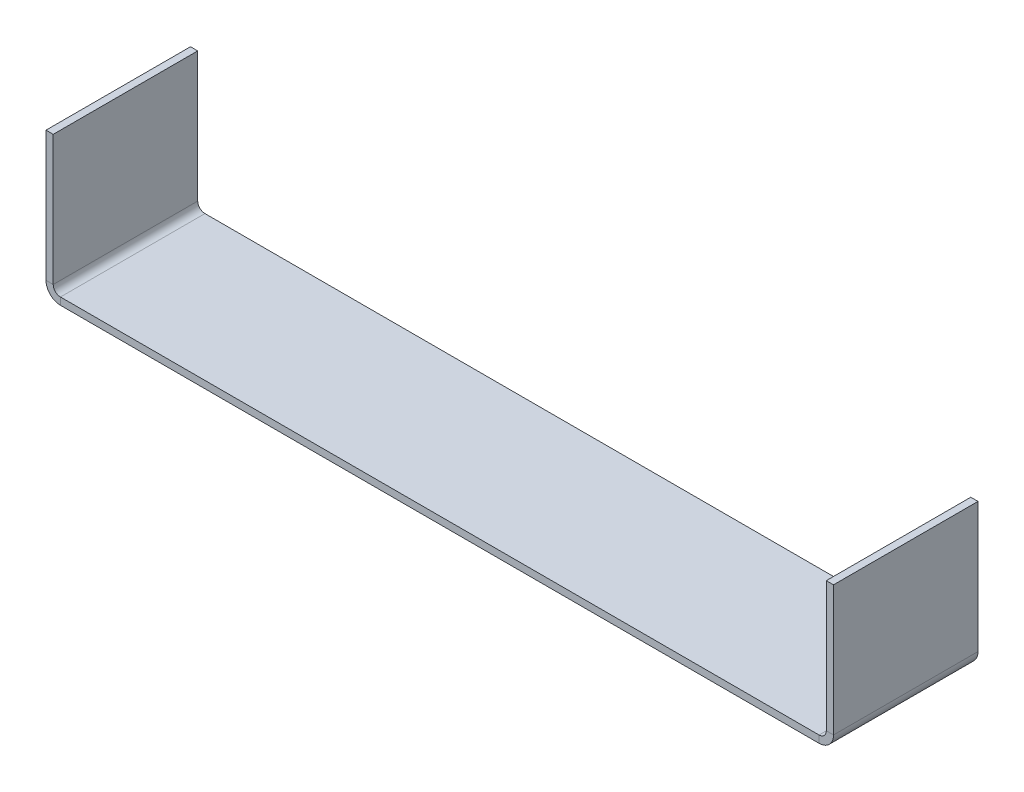
ISO-10303-21;
HEADER;
FILE_DESCRIPTION(('STEP AP214'),'2;1');
FILE_NAME('part.step','',(''),(''),'','','');
FILE_SCHEMA(('AUTOMOTIVE_DESIGN { 1 0 10303 214 1 1 1 1 }'));
ENDSEC;
DATA;
#1=APPLICATION_CONTEXT('core data for automotive mechanical design processes');
#2=APPLICATION_PROTOCOL_DEFINITION('international standard','automotive_design',2000,#1);
#3=PRODUCT_CONTEXT('',#1,'mechanical');
#4=PRODUCT('Part','Part','',(#3));
#5=PRODUCT_RELATED_PRODUCT_CATEGORY('part','',(#4));
#6=PRODUCT_DEFINITION_FORMATION('','',#4);
#7=PRODUCT_DEFINITION_CONTEXT('part definition',#1,'design');
#8=PRODUCT_DEFINITION('design','',#6,#7);
#9=PRODUCT_DEFINITION_SHAPE('','',#8);
#10=(LENGTH_UNIT() NAMED_UNIT(*) SI_UNIT(.MILLI.,.METRE.));
#11=(NAMED_UNIT(*) PLANE_ANGLE_UNIT() SI_UNIT($,.RADIAN.));
#12=(NAMED_UNIT(*) SI_UNIT($,.STERADIAN.) SOLID_ANGLE_UNIT());
#13=UNCERTAINTY_MEASURE_WITH_UNIT(LENGTH_MEASURE(1.E-05),#10,'distance_accuracy_value','');
#14=(GEOMETRIC_REPRESENTATION_CONTEXT(3) GLOBAL_UNCERTAINTY_ASSIGNED_CONTEXT((#13)) GLOBAL_UNIT_ASSIGNED_CONTEXT((#10,
#11,#12)) REPRESENTATION_CONTEXT('',''));
#15=CARTESIAN_POINT('',(0.,0.,0.));
#16=DIRECTION('',(0.,0.,1.));
#17=DIRECTION('',(1.,0.,0.));
#18=AXIS2_PLACEMENT_3D('',#15,#16,#17);
#19=CARTESIAN_POINT('',(0.,2.,0.));
#20=DIRECTION('',(0.,-1.,0.));
#21=DIRECTION('',(0.,0.,-1.));
#22=AXIS2_PLACEMENT_3D('',#19,#20,#21);
#23=PLANE('',#22);
#24=DIRECTION('',(0.,0.,-1.));
#25=VECTOR('',#24,1.);
#26=CARTESIAN_POINT('',(214.,2.00000000000001,-40.));
#27=LINE('',#26,#25);
#28=CARTESIAN_POINT('',(214.,2.00000000000001,-40.));
#29=VERTEX_POINT('',#28);
#30=CARTESIAN_POINT('',(214.,2.00000000000001,0.));
#31=VERTEX_POINT('',#30);
#32=EDGE_CURVE('E219',#29,#31,#27,.F.);
#33=ORIENTED_EDGE('',*,*,#32,.F.);
#34=DIRECTION('',(-1.,0.,0.));
#35=VECTOR('',#34,1.);
#36=CARTESIAN_POINT('',(0.,2.,-40.));
#37=LINE('',#36,#35);
#38=CARTESIAN_POINT('',(3.99999999999999,2.,-40.));
#39=VERTEX_POINT('',#38);
#40=EDGE_CURVE('E13',#29,#39,#37,.T.);
#41=ORIENTED_EDGE('',*,*,#40,.T.);
#42=DIRECTION('',(0.,0.,1.));
#43=VECTOR('',#42,1.);
#44=CARTESIAN_POINT('',(3.99999999999999,2.,0.));
#45=LINE('',#44,#43);
#46=CARTESIAN_POINT('',(3.99999999999999,2.,0.));
#47=VERTEX_POINT('',#46);
#48=EDGE_CURVE('E145',#47,#39,#45,.F.);
#49=ORIENTED_EDGE('',*,*,#48,.F.);
#50=DIRECTION('',(1.,0.,0.));
#51=VECTOR('',#50,1.);
#52=CARTESIAN_POINT('',(0.,2.,0.));
#53=LINE('',#52,#51);
#54=EDGE_CURVE('E86',#47,#31,#53,.T.);
#55=ORIENTED_EDGE('',*,*,#54,.T.);
#56=EDGE_LOOP('',(#33,#41,#49,#55));
#57=FACE_BOUND('',#56,.T.);
#58=ADVANCED_FACE('F77',(#57),#23,.F.);
#59=CARTESIAN_POINT('',(0.,0.,0.));
#60=DIRECTION('',(0.,-1.,0.));
#61=DIRECTION('',(0.,0.,-1.));
#62=AXIS2_PLACEMENT_3D('',#59,#60,#61);
#63=PLANE('',#62);
#64=DIRECTION('',(1.,0.,0.));
#65=VECTOR('',#64,1.);
#66=CARTESIAN_POINT('',(0.,0.,-40.));
#67=LINE('',#66,#65);
#68=CARTESIAN_POINT('',(214.,0.,-40.));
#69=VERTEX_POINT('',#68);
#70=CARTESIAN_POINT('',(3.99999999999999,0.,-40.));
#71=VERTEX_POINT('',#70);
#72=EDGE_CURVE('E94',#69,#71,#67,.F.);
#73=ORIENTED_EDGE('',*,*,#72,.F.);
#74=DIRECTION('',(0.,0.,-1.));
#75=VECTOR('',#74,1.);
#76=CARTESIAN_POINT('',(214.,0.,-40.));
#77=LINE('',#76,#75);
#78=CARTESIAN_POINT('',(214.,0.,0.));
#79=VERTEX_POINT('',#78);
#80=EDGE_CURVE('E201',#69,#79,#77,.F.);
#81=ORIENTED_EDGE('',*,*,#80,.T.);
#82=DIRECTION('',(1.,0.,0.));
#83=VECTOR('',#82,1.);
#84=CARTESIAN_POINT('',(0.,0.,0.));
#85=LINE('',#84,#83);
#86=CARTESIAN_POINT('',(3.99999999999999,0.,0.));
#87=VERTEX_POINT('',#86);
#88=EDGE_CURVE('E81',#87,#79,#85,.T.);
#89=ORIENTED_EDGE('',*,*,#88,.F.);
#90=DIRECTION('',(0.,0.,1.));
#91=VECTOR('',#90,1.);
#92=CARTESIAN_POINT('',(3.99999999999999,0.,0.));
#93=LINE('',#92,#91);
#94=EDGE_CURVE('E102',#87,#71,#93,.F.);
#95=ORIENTED_EDGE('',*,*,#94,.T.);
#96=EDGE_LOOP('',(#73,#81,#89,#95));
#97=FACE_BOUND('',#96,.T.);
#98=ADVANCED_FACE('F199',(#97),#63,.T.);
#99=CARTESIAN_POINT('',(0.,2.,-40.));
#100=DIRECTION('',(0.,0.,1.));
#101=DIRECTION('',(-1.,0.,0.));
#102=AXIS2_PLACEMENT_3D('',#99,#100,#101);
#103=PLANE('',#102);
#104=ORIENTED_EDGE('',*,*,#40,.F.);
#105=DIRECTION('',(0.,-1.,0.));
#106=VECTOR('',#105,1.);
#107=CARTESIAN_POINT('',(214.,2.00000000000001,-40.));
#108=LINE('',#107,#106);
#109=EDGE_CURVE('E209',#29,#69,#108,.T.);
#110=ORIENTED_EDGE('',*,*,#109,.T.);
#111=ORIENTED_EDGE('',*,*,#72,.T.);
#112=DIRECTION('',(0.,-1.,0.));
#113=VECTOR('',#112,1.);
#114=CARTESIAN_POINT('',(3.99999999999999,2.,-40.));
#115=LINE('',#114,#113);
#116=EDGE_CURVE('E181',#39,#71,#115,.T.);
#117=ORIENTED_EDGE('',*,*,#116,.F.);
#118=EDGE_LOOP('',(#104,#110,#111,#117));
#119=FACE_BOUND('',#118,.T.);
#120=ADVANCED_FACE('F254',(#119),#103,.F.);
#121=CARTESIAN_POINT('',(0.,2.,0.));
#122=DIRECTION('',(0.,0.,-1.));
#123=DIRECTION('',(1.,0.,0.));
#124=AXIS2_PLACEMENT_3D('',#121,#122,#123);
#125=PLANE('',#124);
#126=DIRECTION('',(0.,-1.,0.));
#127=VECTOR('',#126,1.);
#128=CARTESIAN_POINT('',(214.,2.00000000000001,0.));
#129=LINE('',#128,#127);
#130=EDGE_CURVE('E172',#31,#79,#129,.T.);
#131=ORIENTED_EDGE('',*,*,#130,.F.);
#132=ORIENTED_EDGE('',*,*,#54,.F.);
#133=DIRECTION('',(0.,-1.,0.));
#134=VECTOR('',#133,1.);
#135=CARTESIAN_POINT('',(3.99999999999999,2.,0.));
#136=LINE('',#135,#134);
#137=EDGE_CURVE('E144',#47,#87,#136,.T.);
#138=ORIENTED_EDGE('',*,*,#137,.T.);
#139=ORIENTED_EDGE('',*,*,#88,.T.);
#140=EDGE_LOOP('',(#131,#132,#138,#139));
#141=FACE_BOUND('',#140,.T.);
#142=ADVANCED_FACE('F79',(#141),#125,.F.);
#143=CARTESIAN_POINT('',(3.99999999999999,4.,-40.));
#144=DIRECTION('',(0.,0.,-1.));
#145=DIRECTION('',(-1.,0.,0.));
#146=AXIS2_PLACEMENT_3D('',#143,#144,#145);
#147=PLANE('',#146);
#148=DIRECTION('',(1.,0.,0.));
#149=VECTOR('',#148,1.);
#150=CARTESIAN_POINT('',(0.,3.99999999999999,-40.));
#151=LINE('',#150,#149);
#152=CARTESIAN_POINT('',(1.99999999999999,3.99999999999999,-40.));
#153=VERTEX_POINT('',#152);
#154=CARTESIAN_POINT('',(0.,3.99999999999999,-40.));
#155=VERTEX_POINT('',#154);
#156=EDGE_CURVE('E135',#153,#155,#151,.F.);
#157=ORIENTED_EDGE('',*,*,#156,.F.);
#158=CARTESIAN_POINT('',(3.99999999999999,4.,-40.));
#159=DIRECTION('',(0.,0.,1.));
#160=DIRECTION('',(1.,0.,0.));
#161=AXIS2_PLACEMENT_3D('',#158,#159,#160);
#162=CIRCLE('',#161,2.);
#163=EDGE_CURVE('E129',#39,#153,#162,.F.);
#164=ORIENTED_EDGE('',*,*,#163,.F.);
#165=ORIENTED_EDGE('',*,*,#116,.T.);
#166=CARTESIAN_POINT('',(3.99999999999999,4.,-40.));
#167=DIRECTION('',(0.,0.,1.));
#168=DIRECTION('',(1.,0.,0.));
#169=AXIS2_PLACEMENT_3D('',#166,#167,#168);
#170=CIRCLE('',#169,4.);
#171=EDGE_CURVE('E174',#71,#155,#170,.F.);
#172=ORIENTED_EDGE('',*,*,#171,.T.);
#173=EDGE_LOOP('',(#157,#164,#165,#172));
#174=FACE_BOUND('',#173,.T.);
#175=ADVANCED_FACE('F252',(#174),#147,.T.);
#176=CARTESIAN_POINT('',(3.99999999999999,4.,0.));
#177=DIRECTION('',(0.,0.,-1.));
#178=DIRECTION('',(-1.,0.,0.));
#179=AXIS2_PLACEMENT_3D('',#176,#177,#178);
#180=PLANE('',#179);
#181=CARTESIAN_POINT('',(3.99999999999999,4.,0.));
#182=DIRECTION('',(0.,0.,1.));
#183=DIRECTION('',(1.,0.,0.));
#184=AXIS2_PLACEMENT_3D('',#181,#182,#183);
#185=CIRCLE('',#184,2.);
#186=CARTESIAN_POINT('',(1.99999999999999,3.99999999999999,0.));
#187=VERTEX_POINT('',#186);
#188=EDGE_CURVE('E126',#187,#47,#185,.T.);
#189=ORIENTED_EDGE('',*,*,#188,.F.);
#190=DIRECTION('',(1.,0.,0.));
#191=VECTOR('',#190,1.);
#192=CARTESIAN_POINT('',(1.99999999999999,3.99999999999999,0.));
#193=LINE('',#192,#191);
#194=CARTESIAN_POINT('',(0.,3.99999999999999,0.));
#195=VERTEX_POINT('',#194);
#196=EDGE_CURVE('E134',#187,#195,#193,.F.);
#197=ORIENTED_EDGE('',*,*,#196,.T.);
#198=CARTESIAN_POINT('',(3.99999999999999,4.,0.));
#199=DIRECTION('',(0.,0.,1.));
#200=DIRECTION('',(1.,0.,0.));
#201=AXIS2_PLACEMENT_3D('',#198,#199,#200);
#202=CIRCLE('',#201,4.);
#203=EDGE_CURVE('E175',#195,#87,#202,.T.);
#204=ORIENTED_EDGE('',*,*,#203,.T.);
#205=ORIENTED_EDGE('',*,*,#137,.F.);
#206=EDGE_LOOP('',(#189,#197,#204,#205));
#207=FACE_BOUND('',#206,.T.);
#208=ADVANCED_FACE('F140',(#207),#180,.F.);
#209=CARTESIAN_POINT('',(3.99999999999999,4.,0.));
#210=DIRECTION('',(0.,0.,1.));
#211=DIRECTION('',(-1.,0.,0.));
#212=AXIS2_PLACEMENT_3D('',#209,#210,#211);
#213=CYLINDRICAL_SURFACE('',#212,4.);
#214=ORIENTED_EDGE('',*,*,#94,.F.);
#215=ORIENTED_EDGE('',*,*,#203,.F.);
#216=DIRECTION('',(0.,0.,1.));
#217=VECTOR('',#216,1.);
#218=CARTESIAN_POINT('',(0.,3.99999999999999,-40.));
#219=LINE('',#218,#217);
#220=EDGE_CURVE('E158',#195,#155,#219,.F.);
#221=ORIENTED_EDGE('',*,*,#220,.T.);
#222=ORIENTED_EDGE('',*,*,#171,.F.);
#223=EDGE_LOOP('',(#214,#215,#221,#222));
#224=FACE_BOUND('',#223,.T.);
#225=ADVANCED_FACE('F249',(#224),#213,.T.);
#226=CARTESIAN_POINT('',(3.99999999999999,4.,0.));
#227=DIRECTION('',(0.,0.,1.));
#228=DIRECTION('',(-1.,0.,0.));
#229=AXIS2_PLACEMENT_3D('',#226,#227,#228);
#230=CYLINDRICAL_SURFACE('',#229,2.);
#231=ORIENTED_EDGE('',*,*,#48,.T.);
#232=ORIENTED_EDGE('',*,*,#163,.T.);
#233=DIRECTION('',(0.,0.,1.));
#234=VECTOR('',#233,1.);
#235=CARTESIAN_POINT('',(1.99999999999999,3.99999999999999,-40.));
#236=LINE('',#235,#234);
#237=EDGE_CURVE('E122',#153,#187,#236,.T.);
#238=ORIENTED_EDGE('',*,*,#237,.T.);
#239=ORIENTED_EDGE('',*,*,#188,.T.);
#240=EDGE_LOOP('',(#231,#232,#238,#239));
#241=FACE_BOUND('',#240,.T.);
#242=ADVANCED_FACE('F125',(#241),#230,.F.);
#243=CARTESIAN_POINT('',(-1.32706345912226E-13,40.,0.));
#244=DIRECTION('',(0.,0.,-1.));
#245=DIRECTION('',(-1.,0.,0.));
#246=AXIS2_PLACEMENT_3D('',#243,#244,#245);
#247=PLANE('',#246);
#248=ORIENTED_EDGE('',*,*,#196,.F.);
#249=DIRECTION('',(0.,-1.,0.));
#250=VECTOR('',#249,1.);
#251=CARTESIAN_POINT('',(1.99999999999987,40.,0.));
#252=LINE('',#251,#250);
#253=CARTESIAN_POINT('',(1.99999999999987,40.,0.));
#254=VERTEX_POINT('',#253);
#255=EDGE_CURVE('E154',#187,#254,#252,.F.);
#256=ORIENTED_EDGE('',*,*,#255,.T.);
#257=DIRECTION('',(1.,0.,0.));
#258=VECTOR('',#257,1.);
#259=CARTESIAN_POINT('',(-1.32706345912226E-13,40.,0.));
#260=LINE('',#259,#258);
#261=CARTESIAN_POINT('',(-1.32720440540468E-13,40.,0.));
#262=VERTEX_POINT('',#261);
#263=EDGE_CURVE('E146',#262,#254,#260,.T.);
#264=ORIENTED_EDGE('',*,*,#263,.F.);
#265=DIRECTION('',(0.,1.,0.));
#266=VECTOR('',#265,1.);
#267=CARTESIAN_POINT('',(0.,0.,0.));
#268=LINE('',#267,#266);
#269=EDGE_CURVE('E157',#195,#262,#268,.T.);
#270=ORIENTED_EDGE('',*,*,#269,.F.);
#271=EDGE_LOOP('',(#248,#256,#264,#270));
#272=FACE_BOUND('',#271,.T.);
#273=ADVANCED_FACE('F151',(#272),#247,.F.);
#274=CARTESIAN_POINT('',(0.,1.99999999999999,-40.));
#275=DIRECTION('',(0.,0.,1.));
#276=DIRECTION('',(1.,0.,0.));
#277=AXIS2_PLACEMENT_3D('',#274,#275,#276);
#278=PLANE('',#277);
#279=ORIENTED_EDGE('',*,*,#156,.T.);
#280=DIRECTION('',(0.,-1.,0.));
#281=VECTOR('',#280,1.);
#282=CARTESIAN_POINT('',(0.,0.,-40.));
#283=LINE('',#282,#281);
#284=CARTESIAN_POINT('',(-1.32720440540468E-13,40.,-40.));
#285=VERTEX_POINT('',#284);
#286=EDGE_CURVE('E232',#285,#155,#283,.T.);
#287=ORIENTED_EDGE('',*,*,#286,.F.);
#288=DIRECTION('',(1.,0.,0.));
#289=VECTOR('',#288,1.);
#290=CARTESIAN_POINT('',(-1.32676367722157E-13,40.,-40.));
#291=LINE('',#290,#289);
#292=CARTESIAN_POINT('',(1.99999999999987,40.,-40.));
#293=VERTEX_POINT('',#292);
#294=EDGE_CURVE('E229',#285,#293,#291,.T.);
#295=ORIENTED_EDGE('',*,*,#294,.T.);
#296=DIRECTION('',(0.,1.,0.));
#297=VECTOR('',#296,1.);
#298=CARTESIAN_POINT('',(2.,2.,-40.));
#299=LINE('',#298,#297);
#300=EDGE_CURVE('E165',#293,#153,#299,.F.);
#301=ORIENTED_EDGE('',*,*,#300,.T.);
#302=EDGE_LOOP('',(#279,#287,#295,#301));
#303=FACE_BOUND('',#302,.T.);
#304=ADVANCED_FACE('F239',(#303),#278,.F.);
#305=CARTESIAN_POINT('',(0.,0.,0.));
#306=DIRECTION('',(1.,0.,0.));
#307=DIRECTION('',(0.,1.,0.));
#308=AXIS2_PLACEMENT_3D('',#305,#306,#307);
#309=PLANE('',#308);
#310=ORIENTED_EDGE('',*,*,#220,.F.);
#311=ORIENTED_EDGE('',*,*,#269,.T.);
#312=DIRECTION('',(0.,0.,-1.));
#313=VECTOR('',#312,1.);
#314=CARTESIAN_POINT('',(-1.32720440540468E-13,40.,0.));
#315=LINE('',#314,#313);
#316=EDGE_CURVE('E235',#262,#285,#315,.T.);
#317=ORIENTED_EDGE('',*,*,#316,.T.);
#318=ORIENTED_EDGE('',*,*,#286,.T.);
#319=EDGE_LOOP('',(#310,#311,#317,#318));
#320=FACE_BOUND('',#319,.T.);
#321=ADVANCED_FACE('F335',(#320),#309,.F.);
#322=CARTESIAN_POINT('',(2.00000000000001,0.,0.));
#323=DIRECTION('',(1.,0.,0.));
#324=DIRECTION('',(0.,1.,0.));
#325=AXIS2_PLACEMENT_3D('',#322,#323,#324);
#326=PLANE('',#325);
#327=ORIENTED_EDGE('',*,*,#255,.F.);
#328=ORIENTED_EDGE('',*,*,#237,.F.);
#329=ORIENTED_EDGE('',*,*,#300,.F.);
#330=DIRECTION('',(0.,0.,1.));
#331=VECTOR('',#330,1.);
#332=CARTESIAN_POINT('',(1.99999999999987,40.,-40.));
#333=LINE('',#332,#331);
#334=EDGE_CURVE('E163',#254,#293,#333,.F.);
#335=ORIENTED_EDGE('',*,*,#334,.F.);
#336=EDGE_LOOP('',(#327,#328,#329,#335));
#337=FACE_BOUND('',#336,.T.);
#338=ADVANCED_FACE('F161',(#337),#326,.T.);
#339=CARTESIAN_POINT('',(-1.32706345912226E-13,40.,-40.));
#340=DIRECTION('',(0.,-1.,0.));
#341=DIRECTION('',(1.,0.,0.));
#342=AXIS2_PLACEMENT_3D('',#339,#340,#341);
#343=PLANE('',#342);
#344=ORIENTED_EDGE('',*,*,#334,.T.);
#345=ORIENTED_EDGE('',*,*,#294,.F.);
#346=ORIENTED_EDGE('',*,*,#316,.F.);
#347=ORIENTED_EDGE('',*,*,#263,.T.);
#348=EDGE_LOOP('',(#344,#345,#346,#347));
#349=FACE_BOUND('',#348,.T.);
#350=ADVANCED_FACE('F336',(#349),#343,.F.);
#351=CARTESIAN_POINT('',(214.,4.00000000000001,0.));
#352=DIRECTION('',(0.,0.,1.));
#353=DIRECTION('',(1.,0.,0.));
#354=AXIS2_PLACEMENT_3D('',#351,#352,#353);
#355=PLANE('',#354);
#356=DIRECTION('',(-1.,0.,0.));
#357=VECTOR('',#356,1.);
#358=CARTESIAN_POINT('',(218.,4.,0.));
#359=LINE('',#358,#357);
#360=CARTESIAN_POINT('',(216.,4.,0.));
#361=VERTEX_POINT('',#360);
#362=CARTESIAN_POINT('',(218.,4.,0.));
#363=VERTEX_POINT('',#362);
#364=EDGE_CURVE('E214',#361,#363,#359,.F.);
#365=ORIENTED_EDGE('',*,*,#364,.F.);
#366=CARTESIAN_POINT('',(214.,4.00000000000001,0.));
#367=DIRECTION('',(0.,0.,-1.));
#368=DIRECTION('',(-1.,0.,0.));
#369=AXIS2_PLACEMENT_3D('',#366,#367,#368);
#370=CIRCLE('',#369,2.);
#371=EDGE_CURVE('E211',#31,#361,#370,.F.);
#372=ORIENTED_EDGE('',*,*,#371,.F.);
#373=ORIENTED_EDGE('',*,*,#130,.T.);
#374=CARTESIAN_POINT('',(214.,4.00000000000001,0.));
#375=DIRECTION('',(0.,0.,-1.));
#376=DIRECTION('',(-1.,0.,0.));
#377=AXIS2_PLACEMENT_3D('',#374,#375,#376);
#378=CIRCLE('',#377,4.);
#379=EDGE_CURVE('E205',#79,#363,#378,.F.);
#380=ORIENTED_EDGE('',*,*,#379,.T.);
#381=EDGE_LOOP('',(#365,#372,#373,#380));
#382=FACE_BOUND('',#381,.T.);
#383=ADVANCED_FACE('F272',(#382),#355,.T.);
#384=CARTESIAN_POINT('',(214.,4.00000000000001,-40.));
#385=DIRECTION('',(0.,0.,1.));
#386=DIRECTION('',(1.,0.,0.));
#387=AXIS2_PLACEMENT_3D('',#384,#385,#386);
#388=PLANE('',#387);
#389=CARTESIAN_POINT('',(214.,4.00000000000001,-40.));
#390=DIRECTION('',(0.,0.,-1.));
#391=DIRECTION('',(-1.,0.,0.));
#392=AXIS2_PLACEMENT_3D('',#389,#390,#391);
#393=CIRCLE('',#392,2.);
#394=CARTESIAN_POINT('',(216.,4.,-40.));
#395=VERTEX_POINT('',#394);
#396=EDGE_CURVE('E222',#395,#29,#393,.T.);
#397=ORIENTED_EDGE('',*,*,#396,.F.);
#398=DIRECTION('',(-1.,0.,0.));
#399=VECTOR('',#398,1.);
#400=CARTESIAN_POINT('',(216.,4.,-40.));
#401=LINE('',#400,#399);
#402=CARTESIAN_POINT('',(218.,4.,-40.));
#403=VERTEX_POINT('',#402);
#404=EDGE_CURVE('E281',#395,#403,#401,.F.);
#405=ORIENTED_EDGE('',*,*,#404,.T.);
#406=CARTESIAN_POINT('',(214.,4.00000000000001,-40.));
#407=DIRECTION('',(0.,0.,-1.));
#408=DIRECTION('',(-1.,0.,0.));
#409=AXIS2_PLACEMENT_3D('',#406,#407,#408);
#410=CIRCLE('',#409,4.);
#411=EDGE_CURVE('E206',#403,#69,#410,.T.);
#412=ORIENTED_EDGE('',*,*,#411,.T.);
#413=ORIENTED_EDGE('',*,*,#109,.F.);
#414=EDGE_LOOP('',(#397,#405,#412,#413));
#415=FACE_BOUND('',#414,.T.);
#416=ADVANCED_FACE('F343',(#415),#388,.F.);
#417=CARTESIAN_POINT('',(214.,4.00000000000001,-40.));
#418=DIRECTION('',(0.,0.,-1.));
#419=DIRECTION('',(1.,0.,0.));
#420=AXIS2_PLACEMENT_3D('',#417,#418,#419);
#421=CYLINDRICAL_SURFACE('',#420,4.);
#422=ORIENTED_EDGE('',*,*,#80,.F.);
#423=ORIENTED_EDGE('',*,*,#411,.F.);
#424=DIRECTION('',(0.,0.,-1.));
#425=VECTOR('',#424,1.);
#426=CARTESIAN_POINT('',(218.,4.,0.));
#427=LINE('',#426,#425);
#428=EDGE_CURVE('E283',#403,#363,#427,.F.);
#429=ORIENTED_EDGE('',*,*,#428,.T.);
#430=ORIENTED_EDGE('',*,*,#379,.F.);
#431=EDGE_LOOP('',(#422,#423,#429,#430));
#432=FACE_BOUND('',#431,.T.);
#433=ADVANCED_FACE('F380',(#432),#421,.T.);
#434=CARTESIAN_POINT('',(214.,4.00000000000001,-40.));
#435=DIRECTION('',(0.,0.,-1.));
#436=DIRECTION('',(1.,0.,0.));
#437=AXIS2_PLACEMENT_3D('',#434,#435,#436);
#438=CYLINDRICAL_SURFACE('',#437,2.);
#439=ORIENTED_EDGE('',*,*,#32,.T.);
#440=ORIENTED_EDGE('',*,*,#371,.T.);
#441=DIRECTION('',(0.,0.,-1.));
#442=VECTOR('',#441,1.);
#443=CARTESIAN_POINT('',(216.,4.,0.));
#444=LINE('',#443,#442);
#445=EDGE_CURVE('E280',#361,#395,#444,.T.);
#446=ORIENTED_EDGE('',*,*,#445,.T.);
#447=ORIENTED_EDGE('',*,*,#396,.T.);
#448=EDGE_LOOP('',(#439,#440,#446,#447));
#449=FACE_BOUND('',#448,.T.);
#450=ADVANCED_FACE('F263',(#449),#438,.F.);
#451=CARTESIAN_POINT('',(218.,40.,-40.));
#452=DIRECTION('',(0.,0.,1.));
#453=DIRECTION('',(1.,0.,0.));
#454=AXIS2_PLACEMENT_3D('',#451,#452,#453);
#455=PLANE('',#454);
#456=ORIENTED_EDGE('',*,*,#404,.F.);
#457=DIRECTION('',(0.,-1.,0.));
#458=VECTOR('',#457,1.);
#459=CARTESIAN_POINT('',(216.,40.,-40.));
#460=LINE('',#459,#458);
#461=CARTESIAN_POINT('',(216.,40.,-40.));
#462=VERTEX_POINT('',#461);
#463=EDGE_CURVE('E288',#395,#462,#460,.F.);
#464=ORIENTED_EDGE('',*,*,#463,.T.);
#465=DIRECTION('',(-1.,0.,0.));
#466=VECTOR('',#465,1.);
#467=CARTESIAN_POINT('',(218.,40.,-40.));
#468=LINE('',#467,#466);
#469=CARTESIAN_POINT('',(218.,40.,-40.));
#470=VERTEX_POINT('',#469);
#471=EDGE_CURVE('E225',#470,#462,#468,.T.);
#472=ORIENTED_EDGE('',*,*,#471,.F.);
#473=DIRECTION('',(0.,1.,0.));
#474=VECTOR('',#473,1.);
#475=CARTESIAN_POINT('',(218.,-8.03129740959995E-13,-40.));
#476=LINE('',#475,#474);
#477=EDGE_CURVE('E296',#403,#470,#476,.T.);
#478=ORIENTED_EDGE('',*,*,#477,.F.);
#479=EDGE_LOOP('',(#456,#464,#472,#478));
#480=FACE_BOUND('',#479,.T.);
#481=ADVANCED_FACE('F385',(#480),#455,.F.);
#482=CARTESIAN_POINT('',(218.,1.99999999999999,0.));
#483=DIRECTION('',(0.,0.,-1.));
#484=DIRECTION('',(-1.,0.,0.));
#485=AXIS2_PLACEMENT_3D('',#482,#483,#484);
#486=PLANE('',#485);
#487=ORIENTED_EDGE('',*,*,#364,.T.);
#488=DIRECTION('',(0.,-1.,0.));
#489=VECTOR('',#488,1.);
#490=CARTESIAN_POINT('',(218.,-8.03129740959995E-13,0.));
#491=LINE('',#490,#489);
#492=CARTESIAN_POINT('',(218.,40.,0.));
#493=VERTEX_POINT('',#492);
#494=EDGE_CURVE('E302',#493,#363,#491,.T.);
#495=ORIENTED_EDGE('',*,*,#494,.F.);
#496=DIRECTION('',(-1.,0.,0.));
#497=VECTOR('',#496,1.);
#498=CARTESIAN_POINT('',(218.,40.,0.));
#499=LINE('',#498,#497);
#500=CARTESIAN_POINT('',(216.,40.,0.));
#501=VERTEX_POINT('',#500);
#502=EDGE_CURVE('E304',#493,#501,#499,.T.);
#503=ORIENTED_EDGE('',*,*,#502,.T.);
#504=DIRECTION('',(0.,1.,0.));
#505=VECTOR('',#504,1.);
#506=CARTESIAN_POINT('',(216.,2.,0.));
#507=LINE('',#506,#505);
#508=EDGE_CURVE('E294',#501,#361,#507,.F.);
#509=ORIENTED_EDGE('',*,*,#508,.T.);
#510=EDGE_LOOP('',(#487,#495,#503,#509));
#511=FACE_BOUND('',#510,.T.);
#512=ADVANCED_FACE('F326',(#511),#486,.F.);
#513=CARTESIAN_POINT('',(218.,-8.03129740959995E-13,0.));
#514=DIRECTION('',(-1.,0.,0.));
#515=DIRECTION('',(0.,-1.,0.));
#516=AXIS2_PLACEMENT_3D('',#513,#514,#515);
#517=PLANE('',#516);
#518=ORIENTED_EDGE('',*,*,#428,.F.);
#519=ORIENTED_EDGE('',*,*,#477,.T.);
#520=DIRECTION('',(0.,0.,1.));
#521=VECTOR('',#520,1.);
#522=CARTESIAN_POINT('',(218.,40.,0.));
#523=LINE('',#522,#521);
#524=EDGE_CURVE('E299',#470,#493,#523,.T.);
#525=ORIENTED_EDGE('',*,*,#524,.T.);
#526=ORIENTED_EDGE('',*,*,#494,.T.);
#527=EDGE_LOOP('',(#518,#519,#525,#526));
#528=FACE_BOUND('',#527,.T.);
#529=ADVANCED_FACE('F394',(#528),#517,.F.);
#530=CARTESIAN_POINT('',(216.,-7.96146774237776E-13,0.));
#531=DIRECTION('',(-1.,0.,0.));
#532=DIRECTION('',(0.,-1.,0.));
#533=AXIS2_PLACEMENT_3D('',#530,#531,#532);
#534=PLANE('',#533);
#535=ORIENTED_EDGE('',*,*,#463,.F.);
#536=ORIENTED_EDGE('',*,*,#445,.F.);
#537=ORIENTED_EDGE('',*,*,#508,.F.);
#538=DIRECTION('',(0.,0.,-1.));
#539=VECTOR('',#538,1.);
#540=CARTESIAN_POINT('',(216.,40.,0.));
#541=LINE('',#540,#539);
#542=EDGE_CURVE('E291',#462,#501,#541,.F.);
#543=ORIENTED_EDGE('',*,*,#542,.F.);
#544=EDGE_LOOP('',(#535,#536,#537,#543));
#545=FACE_BOUND('',#544,.T.);
#546=ADVANCED_FACE('F324',(#545),#534,.T.);
#547=CARTESIAN_POINT('',(218.,40.,0.));
#548=DIRECTION('',(0.,-1.,0.));
#549=DIRECTION('',(1.,0.,0.));
#550=AXIS2_PLACEMENT_3D('',#547,#548,#549);
#551=PLANE('',#550);
#552=ORIENTED_EDGE('',*,*,#542,.T.);
#553=ORIENTED_EDGE('',*,*,#502,.F.);
#554=ORIENTED_EDGE('',*,*,#524,.F.);
#555=ORIENTED_EDGE('',*,*,#471,.T.);
#556=EDGE_LOOP('',(#552,#553,#554,#555));
#557=FACE_BOUND('',#556,.T.);
#558=ADVANCED_FACE('F313',(#557),#551,.F.);
#559=CLOSED_SHELL('',(#58,#98,#120,#142,#175,#208,#225,#242,#273,#304,#321,#338,#350,#383,#416,
#433,#450,#481,#512,#529,#546,#558));
#560=MANIFOLD_SOLID_BREP('B2',#559);
#561=ADVANCED_BREP_SHAPE_REPRESENTATION('',(#18,#560),#14);
#562=SHAPE_DEFINITION_REPRESENTATION(#9,#561);
ENDSEC;
END-ISO-10303-21;
